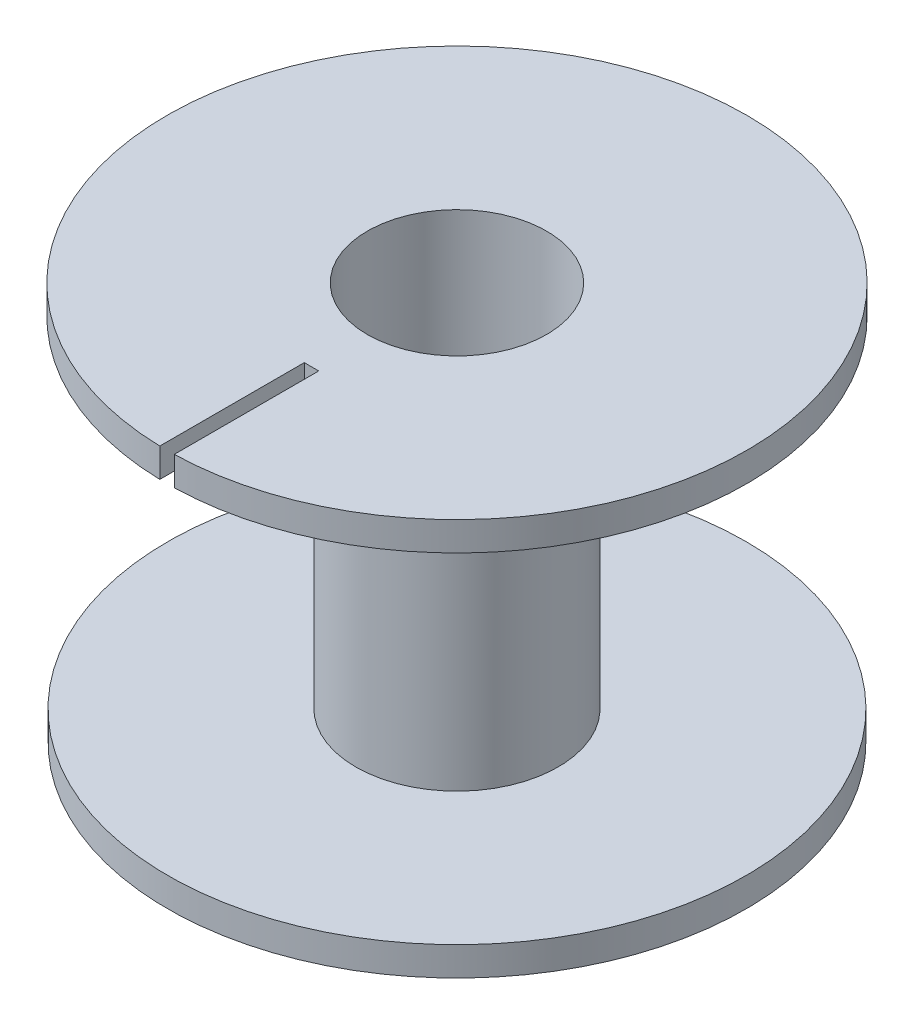
ISO-10303-21;
HEADER;
FILE_DESCRIPTION(('STEP AP214'),'2;1');
FILE_NAME('part.step','',(''),(''),'','','');
FILE_SCHEMA(('AUTOMOTIVE_DESIGN { 1 0 10303 214 1 1 1 1 }'));
ENDSEC;
DATA;
#1=APPLICATION_CONTEXT('core data for automotive mechanical design processes');
#2=APPLICATION_PROTOCOL_DEFINITION('international standard','automotive_design',2000,#1);
#3=PRODUCT_CONTEXT('',#1,'mechanical');
#4=PRODUCT('Part','Part','',(#3));
#5=PRODUCT_RELATED_PRODUCT_CATEGORY('part','',(#4));
#6=PRODUCT_DEFINITION_FORMATION('','',#4);
#7=PRODUCT_DEFINITION_CONTEXT('part definition',#1,'design');
#8=PRODUCT_DEFINITION('design','',#6,#7);
#9=PRODUCT_DEFINITION_SHAPE('','',#8);
#10=(LENGTH_UNIT() NAMED_UNIT(*) SI_UNIT(.MILLI.,.METRE.));
#11=(NAMED_UNIT(*) PLANE_ANGLE_UNIT() SI_UNIT($,.RADIAN.));
#12=(NAMED_UNIT(*) SI_UNIT($,.STERADIAN.) SOLID_ANGLE_UNIT());
#13=UNCERTAINTY_MEASURE_WITH_UNIT(LENGTH_MEASURE(1.E-05),#10,'distance_accuracy_value','');
#14=(GEOMETRIC_REPRESENTATION_CONTEXT(3) GLOBAL_UNCERTAINTY_ASSIGNED_CONTEXT((#13)) GLOBAL_UNIT_ASSIGNED_CONTEXT((#10,
#11,#12)) REPRESENTATION_CONTEXT('',''));
#15=CARTESIAN_POINT('',(0.,0.,0.));
#16=DIRECTION('',(0.,0.,1.));
#17=DIRECTION('',(1.,0.,0.));
#18=AXIS2_PLACEMENT_3D('',#15,#16,#17);
#19=CARTESIAN_POINT('',(0.500000000000003,2.,10.0584006431389));
#20=DIRECTION('',(1.,0.,0.));
#21=DIRECTION('',(0.,0.,-1.));
#22=AXIS2_PLACEMENT_3D('',#19,#20,#21);
#23=PLANE('',#22);
#24=DIRECTION('',(0.,0.,1.));
#25=VECTOR('',#24,1.);
#26=CARTESIAN_POINT('',(0.500000000000003,0.,10.0584006431389));
#27=LINE('',#26,#25);
#28=CARTESIAN_POINT('',(0.500000000000003,0.,10.0584006431389));
#29=VERTEX_POINT('',#28);
#30=CARTESIAN_POINT('',(0.500000000000004,0.,20.0521678718456));
#31=VERTEX_POINT('',#30);
#32=EDGE_CURVE('E108',#29,#31,#27,.T.);
#33=ORIENTED_EDGE('',*,*,#32,.T.);
#34=DIRECTION('',(0.,-1.,0.));
#35=VECTOR('',#34,1.);
#36=CARTESIAN_POINT('',(0.500000000000004,2.,20.0521678718456));
#37=LINE('',#36,#35);
#38=CARTESIAN_POINT('',(0.500000000000004,2.,20.0521678718456));
#39=VERTEX_POINT('',#38);
#40=EDGE_CURVE('E50',#39,#31,#37,.T.);
#41=ORIENTED_EDGE('',*,*,#40,.F.);
#42=DIRECTION('',(0.,0.,1.));
#43=VECTOR('',#42,1.);
#44=CARTESIAN_POINT('',(0.500000000000003,2.,10.0584006431389));
#45=LINE('',#44,#43);
#46=CARTESIAN_POINT('',(0.500000000000003,2.,10.0584006431389));
#47=VERTEX_POINT('',#46);
#48=EDGE_CURVE('E94',#47,#39,#45,.T.);
#49=ORIENTED_EDGE('',*,*,#48,.F.);
#50=DIRECTION('',(0.,-1.,0.));
#51=VECTOR('',#50,1.);
#52=CARTESIAN_POINT('',(0.500000000000003,2.,10.0584006431389));
#53=LINE('',#52,#51);
#54=EDGE_CURVE('E104',#47,#29,#53,.T.);
#55=ORIENTED_EDGE('',*,*,#54,.T.);
#56=EDGE_LOOP('',(#33,#41,#49,#55));
#57=FACE_BOUND('',#56,.T.);
#58=ADVANCED_FACE('F42',(#57),#23,.F.);
#59=CARTESIAN_POINT('',(0.,2.,0.));
#60=DIRECTION('',(0.,-1.,0.));
#61=DIRECTION('',(0.,0.,-1.));
#62=AXIS2_PLACEMENT_3D('',#59,#60,#61);
#63=CYLINDRICAL_SURFACE('',#62,20.0584006431389);
#64=CARTESIAN_POINT('',(0.,0.,0.));
#65=DIRECTION('',(0.,1.,0.));
#66=DIRECTION('',(0.,0.,1.));
#67=AXIS2_PLACEMENT_3D('',#64,#65,#66);
#68=CIRCLE('',#67,20.0584006431389);
#69=CARTESIAN_POINT('',(-0.500000000000004,0.,20.0521678718456));
#70=VERTEX_POINT('',#69);
#71=EDGE_CURVE('E99',#31,#70,#68,.T.);
#72=ORIENTED_EDGE('',*,*,#71,.T.);
#73=DIRECTION('',(0.,-1.,0.));
#74=VECTOR('',#73,1.);
#75=CARTESIAN_POINT('',(-0.500000000000004,2.,20.0521678718456));
#76=LINE('',#75,#74);
#77=CARTESIAN_POINT('',(-0.500000000000004,2.,20.0521678718456));
#78=VERTEX_POINT('',#77);
#79=EDGE_CURVE('E97',#78,#70,#76,.T.);
#80=ORIENTED_EDGE('',*,*,#79,.F.);
#81=CARTESIAN_POINT('',(0.,2.,0.));
#82=DIRECTION('',(0.,1.,0.));
#83=DIRECTION('',(0.,0.,1.));
#84=AXIS2_PLACEMENT_3D('',#81,#82,#83);
#85=CIRCLE('',#84,20.0584006431389);
#86=EDGE_CURVE('E89',#39,#78,#85,.T.);
#87=ORIENTED_EDGE('',*,*,#86,.F.);
#88=ORIENTED_EDGE('',*,*,#40,.T.);
#89=EDGE_LOOP('',(#72,#80,#87,#88));
#90=FACE_BOUND('',#89,.T.);
#91=ADVANCED_FACE('F98',(#90),#63,.T.);
#92=CARTESIAN_POINT('',(-0.499999999999997,2.,20.0521678718456));
#93=DIRECTION('',(-1.,0.,0.));
#94=DIRECTION('',(0.,0.,1.));
#95=AXIS2_PLACEMENT_3D('',#92,#93,#94);
#96=PLANE('',#95);
#97=DIRECTION('',(0.,0.,-1.));
#98=VECTOR('',#97,1.);
#99=CARTESIAN_POINT('',(-0.499999999999997,0.,20.0521678718456));
#100=LINE('',#99,#98);
#101=CARTESIAN_POINT('',(-0.499999999999997,0.,10.0584006431389));
#102=VERTEX_POINT('',#101);
#103=EDGE_CURVE('E75',#70,#102,#100,.T.);
#104=ORIENTED_EDGE('',*,*,#103,.T.);
#105=DIRECTION('',(0.,-1.,0.));
#106=VECTOR('',#105,1.);
#107=CARTESIAN_POINT('',(-0.499999999999997,2.,10.0584006431389));
#108=LINE('',#107,#106);
#109=CARTESIAN_POINT('',(-0.499999999999997,2.,10.0584006431389));
#110=VERTEX_POINT('',#109);
#111=EDGE_CURVE('E100',#110,#102,#108,.T.);
#112=ORIENTED_EDGE('',*,*,#111,.F.);
#113=DIRECTION('',(0.,0.,-1.));
#114=VECTOR('',#113,1.);
#115=CARTESIAN_POINT('',(-0.499999999999997,2.,20.0521678718456));
#116=LINE('',#115,#114);
#117=EDGE_CURVE('E92',#78,#110,#116,.T.);
#118=ORIENTED_EDGE('',*,*,#117,.F.);
#119=ORIENTED_EDGE('',*,*,#79,.T.);
#120=EDGE_LOOP('',(#104,#112,#118,#119));
#121=FACE_BOUND('',#120,.T.);
#122=ADVANCED_FACE('F102',(#121),#96,.F.);
#123=CARTESIAN_POINT('',(-0.499999999999997,2.,10.0584006431389));
#124=DIRECTION('',(0.,0.,-1.));
#125=DIRECTION('',(-1.,0.,0.));
#126=AXIS2_PLACEMENT_3D('',#123,#124,#125);
#127=PLANE('',#126);
#128=DIRECTION('',(1.,0.,0.));
#129=VECTOR('',#128,1.);
#130=CARTESIAN_POINT('',(-0.499999999999997,0.,10.0584006431389));
#131=LINE('',#130,#129);
#132=EDGE_CURVE('E81',#102,#29,#131,.T.);
#133=ORIENTED_EDGE('',*,*,#132,.T.);
#134=ORIENTED_EDGE('',*,*,#54,.F.);
#135=DIRECTION('',(1.,0.,0.));
#136=VECTOR('',#135,1.);
#137=CARTESIAN_POINT('',(-0.499999999999997,2.,10.0584006431389));
#138=LINE('',#137,#136);
#139=EDGE_CURVE('E58',#110,#47,#138,.T.);
#140=ORIENTED_EDGE('',*,*,#139,.F.);
#141=ORIENTED_EDGE('',*,*,#111,.T.);
#142=EDGE_LOOP('',(#133,#134,#140,#141));
#143=FACE_BOUND('',#142,.T.);
#144=ADVANCED_FACE('F131',(#143),#127,.F.);
#145=CARTESIAN_POINT('',(0.,2.,0.));
#146=DIRECTION('',(0.,1.,0.));
#147=DIRECTION('',(0.,0.,1.));
#148=AXIS2_PLACEMENT_3D('',#145,#146,#147);
#149=PLANE('',#148);
#150=CARTESIAN_POINT('',(0.,2.,0.));
#151=DIRECTION('',(0.,1.,0.));
#152=DIRECTION('',(0.,0.,1.));
#153=AXIS2_PLACEMENT_3D('',#150,#151,#152);
#154=CIRCLE('',#153,6.2);
#155=CARTESIAN_POINT('',(0.,2.,6.2));
#156=VERTEX_POINT('',#155);
#157=EDGE_CURVE('E111',#156,#156,#154,.T.);
#158=ORIENTED_EDGE('',*,*,#157,.F.);
#159=EDGE_LOOP('',(#158));
#160=FACE_BOUND('',#159,.T.);
#161=ORIENTED_EDGE('',*,*,#48,.T.);
#162=ORIENTED_EDGE('',*,*,#86,.T.);
#163=ORIENTED_EDGE('',*,*,#117,.T.);
#164=ORIENTED_EDGE('',*,*,#139,.T.);
#165=EDGE_LOOP('',(#161,#162,#163,#164));
#166=FACE_BOUND('',#165,.T.);
#167=ADVANCED_FACE('F90',(#160,#166),#149,.T.);
#168=CARTESIAN_POINT('',(0.,0.,0.));
#169=DIRECTION('',(0.,1.,0.));
#170=DIRECTION('',(0.,0.,1.));
#171=AXIS2_PLACEMENT_3D('',#168,#169,#170);
#172=PLANE('',#171);
#173=CARTESIAN_POINT('',(0.,0.,0.));
#174=DIRECTION('',(0.,1.,0.));
#175=DIRECTION('',(0.,0.,1.));
#176=AXIS2_PLACEMENT_3D('',#173,#174,#175);
#177=CIRCLE('',#176,7.);
#178=CARTESIAN_POINT('',(0.,0.,7.));
#179=VERTEX_POINT('',#178);
#180=EDGE_CURVE('E11',#179,#179,#177,.F.);
#181=ORIENTED_EDGE('',*,*,#180,.F.);
#182=EDGE_LOOP('',(#181));
#183=FACE_BOUND('',#182,.T.);
#184=ORIENTED_EDGE('',*,*,#32,.F.);
#185=ORIENTED_EDGE('',*,*,#132,.F.);
#186=ORIENTED_EDGE('',*,*,#103,.F.);
#187=ORIENTED_EDGE('',*,*,#71,.F.);
#188=EDGE_LOOP('',(#184,#185,#186,#187));
#189=FACE_BOUND('',#188,.T.);
#190=ADVANCED_FACE('F119',(#183,#189),#172,.F.);
#191=CARTESIAN_POINT('',(0.,0.,0.));
#192=DIRECTION('',(0.,1.,0.));
#193=DIRECTION('',(0.,0.,1.));
#194=AXIS2_PLACEMENT_3D('',#191,#192,#193);
#195=CYLINDRICAL_SURFACE('',#194,6.2);
#196=ORIENTED_EDGE('',*,*,#157,.T.);
#197=EDGE_LOOP('',(#196));
#198=FACE_BOUND('',#197,.T.);
#199=CARTESIAN_POINT('',(0.,-25.5,0.));
#200=DIRECTION('',(0.,-1.,0.));
#201=DIRECTION('',(0.,0.,-1.));
#202=AXIS2_PLACEMENT_3D('',#199,#200,#201);
#203=CIRCLE('',#202,6.2);
#204=CARTESIAN_POINT('',(0.,-25.5,-6.2));
#205=VERTEX_POINT('',#204);
#206=EDGE_CURVE('E251',#205,#205,#203,.T.);
#207=ORIENTED_EDGE('',*,*,#206,.T.);
#208=EDGE_LOOP('',(#207));
#209=FACE_BOUND('',#208,.T.);
#210=ADVANCED_FACE('F121',(#198,#209),#195,.F.);
#211=CARTESIAN_POINT('',(0.,-23.5,0.));
#212=DIRECTION('',(0.,1.,0.));
#213=DIRECTION('',(0.,0.,1.));
#214=AXIS2_PLACEMENT_3D('',#211,#212,#213);
#215=CYLINDRICAL_SURFACE('',#214,7.);
#216=CARTESIAN_POINT('',(0.,-23.5,0.));
#217=DIRECTION('',(0.,-1.,0.));
#218=DIRECTION('',(0.,0.,-1.));
#219=AXIS2_PLACEMENT_3D('',#216,#217,#218);
#220=CIRCLE('',#219,7.);
#221=CARTESIAN_POINT('',(0.,-23.5,-7.));
#222=VERTEX_POINT('',#221);
#223=EDGE_CURVE('E255',#222,#222,#220,.T.);
#224=ORIENTED_EDGE('',*,*,#223,.F.);
#225=EDGE_LOOP('',(#224));
#226=FACE_BOUND('',#225,.T.);
#227=ORIENTED_EDGE('',*,*,#180,.T.);
#228=EDGE_LOOP('',(#227));
#229=FACE_BOUND('',#228,.T.);
#230=ADVANCED_FACE('F128',(#226,#229),#215,.T.);
#231=CARTESIAN_POINT('',(0.,-23.5,0.));
#232=DIRECTION('',(0.,-1.,0.));
#233=DIRECTION('',(0.,0.,-1.));
#234=AXIS2_PLACEMENT_3D('',#231,#232,#233);
#235=PLANE('',#234);
#236=ORIENTED_EDGE('',*,*,#223,.T.);
#237=EDGE_LOOP('',(#236));
#238=FACE_BOUND('',#237,.T.);
#239=CARTESIAN_POINT('',(0.,-23.5,0.));
#240=DIRECTION('',(0.,-1.,0.));
#241=DIRECTION('',(0.,0.,-1.));
#242=AXIS2_PLACEMENT_3D('',#239,#240,#241);
#243=CIRCLE('',#242,20.);
#244=CARTESIAN_POINT('',(0.,-23.5,-20.));
#245=VERTEX_POINT('',#244);
#246=EDGE_CURVE('E256',#245,#245,#243,.T.);
#247=ORIENTED_EDGE('',*,*,#246,.F.);
#248=EDGE_LOOP('',(#247));
#249=FACE_BOUND('',#248,.T.);
#250=ADVANCED_FACE('F169',(#238,#249),#235,.F.);
#251=CARTESIAN_POINT('',(0.,-25.5,0.));
#252=DIRECTION('',(0.,-1.,0.));
#253=DIRECTION('',(0.,0.,-1.));
#254=AXIS2_PLACEMENT_3D('',#251,#252,#253);
#255=PLANE('',#254);
#256=ORIENTED_EDGE('',*,*,#206,.F.);
#257=EDGE_LOOP('',(#256));
#258=FACE_BOUND('',#257,.T.);
#259=CARTESIAN_POINT('',(0.,-25.5,0.));
#260=DIRECTION('',(0.,-1.,0.));
#261=DIRECTION('',(0.,0.,-1.));
#262=AXIS2_PLACEMENT_3D('',#259,#260,#261);
#263=CIRCLE('',#262,20.);
#264=CARTESIAN_POINT('',(0.,-25.5,-20.));
#265=VERTEX_POINT('',#264);
#266=EDGE_CURVE('E254',#265,#265,#263,.T.);
#267=ORIENTED_EDGE('',*,*,#266,.T.);
#268=EDGE_LOOP('',(#267));
#269=FACE_BOUND('',#268,.T.);
#270=ADVANCED_FACE('F181',(#258,#269),#255,.T.);
#271=CARTESIAN_POINT('',(0.,-25.5,0.));
#272=DIRECTION('',(0.,1.,0.));
#273=DIRECTION('',(0.,0.,1.));
#274=AXIS2_PLACEMENT_3D('',#271,#272,#273);
#275=CYLINDRICAL_SURFACE('',#274,20.);
#276=ORIENTED_EDGE('',*,*,#266,.F.);
#277=EDGE_LOOP('',(#276));
#278=FACE_BOUND('',#277,.T.);
#279=ORIENTED_EDGE('',*,*,#246,.T.);
#280=EDGE_LOOP('',(#279));
#281=FACE_BOUND('',#280,.T.);
#282=ADVANCED_FACE('F190',(#278,#281),#275,.T.);
#283=CLOSED_SHELL('',(#58,#91,#122,#144,#167,#190,#210,#230,#250,#270,#282));
#284=MANIFOLD_SOLID_BREP('B2',#283);
#285=ADVANCED_BREP_SHAPE_REPRESENTATION('',(#18,#284),#14);
#286=SHAPE_DEFINITION_REPRESENTATION(#9,#285);
ENDSEC;
END-ISO-10303-21;
